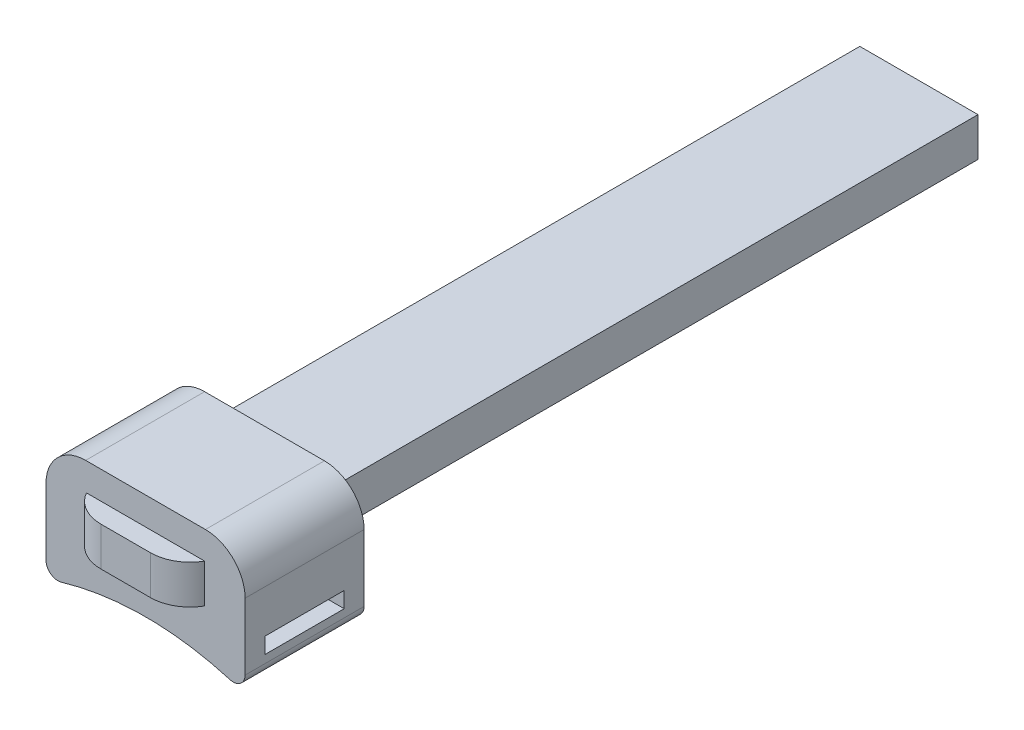
ISO-10303-21;
HEADER;
FILE_DESCRIPTION(('STEP AP214'),'2;1');
FILE_NAME('part.step','',(''),(''),'','','');
FILE_SCHEMA(('AUTOMOTIVE_DESIGN { 1 0 10303 214 1 1 1 1 }'));
ENDSEC;
DATA;
#1=APPLICATION_CONTEXT('core data for automotive mechanical design processes');
#2=APPLICATION_PROTOCOL_DEFINITION('international standard','automotive_design',2000,#1);
#3=PRODUCT_CONTEXT('',#1,'mechanical');
#4=PRODUCT('Part','Part','',(#3));
#5=PRODUCT_RELATED_PRODUCT_CATEGORY('part','',(#4));
#6=PRODUCT_DEFINITION_FORMATION('','',#4);
#7=PRODUCT_DEFINITION_CONTEXT('part definition',#1,'design');
#8=PRODUCT_DEFINITION('design','',#6,#7);
#9=PRODUCT_DEFINITION_SHAPE('','',#8);
#10=(LENGTH_UNIT() NAMED_UNIT(*) SI_UNIT(.MILLI.,.METRE.));
#11=(NAMED_UNIT(*) PLANE_ANGLE_UNIT() SI_UNIT($,.RADIAN.));
#12=(NAMED_UNIT(*) SI_UNIT($,.STERADIAN.) SOLID_ANGLE_UNIT());
#13=UNCERTAINTY_MEASURE_WITH_UNIT(LENGTH_MEASURE(1.E-05),#10,'distance_accuracy_value','');
#14=(GEOMETRIC_REPRESENTATION_CONTEXT(3) GLOBAL_UNCERTAINTY_ASSIGNED_CONTEXT((#13)) GLOBAL_UNIT_ASSIGNED_CONTEXT((#10,
#11,#12)) REPRESENTATION_CONTEXT('',''));
#15=CARTESIAN_POINT('',(0.,0.,0.));
#16=DIRECTION('',(0.,0.,1.));
#17=DIRECTION('',(1.,0.,0.));
#18=AXIS2_PLACEMENT_3D('',#15,#16,#17);
#19=CARTESIAN_POINT('',(-25.1,0.,-35.));
#20=DIRECTION('',(-1.,0.,0.));
#21=DIRECTION('',(0.,0.,1.));
#22=AXIS2_PLACEMENT_3D('',#19,#20,#21);
#23=PLANE('',#22);
#24=DIRECTION('',(0.,-1.,0.));
#25=VECTOR('',#24,1.);
#26=CARTESIAN_POINT('',(-25.1,0.,-5.));
#27=LINE('',#26,#25);
#28=CARTESIAN_POINT('',(-25.1,6.79999999999999,-5.));
#29=VERTEX_POINT('',#28);
#30=CARTESIAN_POINT('',(-25.1,-10.,-5.));
#31=VERTEX_POINT('',#30);
#32=EDGE_CURVE('E261',#29,#31,#27,.T.);
#33=ORIENTED_EDGE('',*,*,#32,.F.);
#34=DIRECTION('',(0.,0.,1.));
#35=VECTOR('',#34,1.);
#36=CARTESIAN_POINT('',(-25.1,6.79999999999999,-35.));
#37=LINE('',#36,#35);
#38=CARTESIAN_POINT('',(-25.1,6.79999999999999,-35.));
#39=VERTEX_POINT('',#38);
#40=EDGE_CURVE('E281',#39,#29,#37,.T.);
#41=ORIENTED_EDGE('',*,*,#40,.F.);
#42=DIRECTION('',(0.,-1.,0.));
#43=VECTOR('',#42,1.);
#44=CARTESIAN_POINT('',(-25.1,0.,-35.));
#45=LINE('',#44,#43);
#46=CARTESIAN_POINT('',(-25.1,-10.,-35.));
#47=VERTEX_POINT('',#46);
#48=EDGE_CURVE('E229',#39,#47,#45,.T.);
#49=ORIENTED_EDGE('',*,*,#48,.T.);
#50=DIRECTION('',(0.,0.,1.));
#51=VECTOR('',#50,1.);
#52=CARTESIAN_POINT('',(-25.1,-10.,-35.));
#53=LINE('',#52,#51);
#54=EDGE_CURVE('E279',#47,#31,#53,.T.);
#55=ORIENTED_EDGE('',*,*,#54,.T.);
#56=EDGE_LOOP('',(#33,#41,#49,#55));
#57=FACE_BOUND('',#56,.T.);
#58=DIRECTION('',(0.,0.,-1.));
#59=VECTOR('',#58,1.);
#60=CARTESIAN_POINT('',(-25.1,-8.,-35.));
#61=LINE('',#60,#59);
#62=CARTESIAN_POINT('',(-25.1,-8.00000000000001,-10.));
#63=VERTEX_POINT('',#62);
#64=CARTESIAN_POINT('',(-25.1,-8.,-30.));
#65=VERTEX_POINT('',#64);
#66=EDGE_CURVE('E206',#63,#65,#61,.T.);
#67=ORIENTED_EDGE('',*,*,#66,.T.);
#68=DIRECTION('',(0.,1.,0.));
#69=VECTOR('',#68,1.);
#70=CARTESIAN_POINT('',(-25.1,0.,-30.));
#71=LINE('',#70,#69);
#72=CARTESIAN_POINT('',(-25.1,-4.00000000000001,-30.));
#73=VERTEX_POINT('',#72);
#74=EDGE_CURVE('E209',#65,#73,#71,.T.);
#75=ORIENTED_EDGE('',*,*,#74,.T.);
#76=DIRECTION('',(0.,0.,1.));
#77=VECTOR('',#76,1.);
#78=CARTESIAN_POINT('',(-25.1,-4.00000000000001,-35.));
#79=LINE('',#78,#77);
#80=CARTESIAN_POINT('',(-25.1,-4.00000000000001,-10.));
#81=VERTEX_POINT('',#80);
#82=EDGE_CURVE('E201',#73,#81,#79,.T.);
#83=ORIENTED_EDGE('',*,*,#82,.T.);
#84=DIRECTION('',(0.,-1.,0.));
#85=VECTOR('',#84,1.);
#86=CARTESIAN_POINT('',(-25.1,0.,-9.99999999999999));
#87=LINE('',#86,#85);
#88=EDGE_CURVE('E182',#81,#63,#87,.T.);
#89=ORIENTED_EDGE('',*,*,#88,.T.);
#90=EDGE_LOOP('',(#67,#75,#83,#89));
#91=FACE_BOUND('',#90,.T.);
#92=ADVANCED_FACE('F40',(#57,#91),#23,.T.);
#93=CARTESIAN_POINT('',(25.1,0.,-35.));
#94=DIRECTION('',(-1.,0.,0.));
#95=DIRECTION('',(0.,0.,1.));
#96=AXIS2_PLACEMENT_3D('',#93,#94,#95);
#97=PLANE('',#96);
#98=DIRECTION('',(0.,-1.,0.));
#99=VECTOR('',#98,1.);
#100=CARTESIAN_POINT('',(25.1,0.,-5.));
#101=LINE('',#100,#99);
#102=CARTESIAN_POINT('',(25.1,6.79999999999999,-5.));
#103=VERTEX_POINT('',#102);
#104=CARTESIAN_POINT('',(25.1,-10.,-5.));
#105=VERTEX_POINT('',#104);
#106=EDGE_CURVE('E249',#103,#105,#101,.T.);
#107=ORIENTED_EDGE('',*,*,#106,.T.);
#108=DIRECTION('',(0.,0.,1.));
#109=VECTOR('',#108,1.);
#110=CARTESIAN_POINT('',(25.1,-10.,-35.));
#111=LINE('',#110,#109);
#112=CARTESIAN_POINT('',(25.1,-10.,-35.));
#113=VERTEX_POINT('',#112);
#114=EDGE_CURVE('E289',#113,#105,#111,.T.);
#115=ORIENTED_EDGE('',*,*,#114,.F.);
#116=DIRECTION('',(0.,-1.,0.));
#117=VECTOR('',#116,1.);
#118=CARTESIAN_POINT('',(25.1,0.,-35.));
#119=LINE('',#118,#117);
#120=CARTESIAN_POINT('',(25.1,6.79999999999999,-35.));
#121=VERTEX_POINT('',#120);
#122=EDGE_CURVE('E219',#121,#113,#119,.T.);
#123=ORIENTED_EDGE('',*,*,#122,.F.);
#124=DIRECTION('',(0.,0.,1.));
#125=VECTOR('',#124,1.);
#126=CARTESIAN_POINT('',(25.1,6.79999999999999,-35.));
#127=LINE('',#126,#125);
#128=EDGE_CURVE('E287',#121,#103,#127,.T.);
#129=ORIENTED_EDGE('',*,*,#128,.T.);
#130=EDGE_LOOP('',(#107,#115,#123,#129));
#131=FACE_BOUND('',#130,.T.);
#132=DIRECTION('',(0.,-1.,0.));
#133=VECTOR('',#132,1.);
#134=CARTESIAN_POINT('',(25.1,0.,-30.));
#135=LINE('',#134,#133);
#136=CARTESIAN_POINT('',(25.1,-4.00000000000001,-30.));
#137=VERTEX_POINT('',#136);
#138=CARTESIAN_POINT('',(25.1,-8.,-30.));
#139=VERTEX_POINT('',#138);
#140=EDGE_CURVE('E63',#137,#139,#135,.T.);
#141=ORIENTED_EDGE('',*,*,#140,.T.);
#142=DIRECTION('',(0.,0.,1.));
#143=VECTOR('',#142,1.);
#144=CARTESIAN_POINT('',(25.1,-8.00000000000001,0.));
#145=LINE('',#144,#143);
#146=CARTESIAN_POINT('',(25.1,-8.00000000000001,-10.));
#147=VERTEX_POINT('',#146);
#148=EDGE_CURVE('E194',#139,#147,#145,.T.);
#149=ORIENTED_EDGE('',*,*,#148,.T.);
#150=DIRECTION('',(0.,1.,0.));
#151=VECTOR('',#150,1.);
#152=CARTESIAN_POINT('',(25.1,0.,-10.));
#153=LINE('',#152,#151);
#154=CARTESIAN_POINT('',(25.1,-4.00000000000001,-10.));
#155=VERTEX_POINT('',#154);
#156=EDGE_CURVE('E179',#147,#155,#153,.T.);
#157=ORIENTED_EDGE('',*,*,#156,.T.);
#158=DIRECTION('',(0.,0.,-1.));
#159=VECTOR('',#158,1.);
#160=CARTESIAN_POINT('',(25.1,-4.00000000000001,0.));
#161=LINE('',#160,#159);
#162=EDGE_CURVE('E188',#155,#137,#161,.T.);
#163=ORIENTED_EDGE('',*,*,#162,.T.);
#164=EDGE_LOOP('',(#141,#149,#157,#163));
#165=FACE_BOUND('',#164,.T.);
#166=ADVANCED_FACE('F192',(#131,#165),#97,.F.);
#167=CARTESIAN_POINT('',(-14.9,0.,-200.));
#168=DIRECTION('',(-1.,0.,0.));
#169=DIRECTION('',(0.,0.,1.));
#170=AXIS2_PLACEMENT_3D('',#167,#168,#169);
#171=PLANE('',#170);
#172=DIRECTION('',(0.,0.,1.));
#173=VECTOR('',#172,1.);
#174=CARTESIAN_POINT('',(-14.9,0.,-200.));
#175=LINE('',#174,#173);
#176=CARTESIAN_POINT('',(-14.9,0.,-200.));
#177=VERTEX_POINT('',#176);
#178=CARTESIAN_POINT('',(-14.9,0.,-35.0000000000001));
#179=VERTEX_POINT('',#178);
#180=EDGE_CURVE('E308',#177,#179,#175,.T.);
#181=ORIENTED_EDGE('',*,*,#180,.T.);
#182=DIRECTION('',(0.,-1.,0.));
#183=VECTOR('',#182,1.);
#184=CARTESIAN_POINT('',(-14.9,0.,-35.));
#185=LINE('',#184,#183);
#186=CARTESIAN_POINT('',(-14.9,9.8,-35.));
#187=VERTEX_POINT('',#186);
#188=EDGE_CURVE('E241',#187,#179,#185,.T.);
#189=ORIENTED_EDGE('',*,*,#188,.F.);
#190=DIRECTION('',(0.,0.,1.));
#191=VECTOR('',#190,1.);
#192=CARTESIAN_POINT('',(-14.9,9.8,-200.));
#193=LINE('',#192,#191);
#194=CARTESIAN_POINT('',(-14.9,9.8,-200.));
#195=VERTEX_POINT('',#194);
#196=EDGE_CURVE('E312',#195,#187,#193,.T.);
#197=ORIENTED_EDGE('',*,*,#196,.F.);
#198=DIRECTION('',(0.,-1.,0.));
#199=VECTOR('',#198,1.);
#200=CARTESIAN_POINT('',(-14.9,0.,-200.));
#201=LINE('',#200,#199);
#202=EDGE_CURVE('E301',#195,#177,#201,.T.);
#203=ORIENTED_EDGE('',*,*,#202,.T.);
#204=EDGE_LOOP('',(#181,#189,#197,#203));
#205=FACE_BOUND('',#204,.T.);
#206=ADVANCED_FACE('F365',(#205),#171,.T.);
#207=CARTESIAN_POINT('',(-14.9,9.8,-200.));
#208=DIRECTION('',(0.,1.,0.));
#209=DIRECTION('',(0.,0.,1.));
#210=AXIS2_PLACEMENT_3D('',#207,#208,#209);
#211=PLANE('',#210);
#212=ORIENTED_EDGE('',*,*,#196,.T.);
#213=DIRECTION('',(-1.,0.,0.));
#214=VECTOR('',#213,1.);
#215=CARTESIAN_POINT('',(0.,9.8,-35.));
#216=LINE('',#215,#214);
#217=CARTESIAN_POINT('',(14.9,9.8,-35.));
#218=VERTEX_POINT('',#217);
#219=EDGE_CURVE('E235',#218,#187,#216,.T.);
#220=ORIENTED_EDGE('',*,*,#219,.F.);
#221=DIRECTION('',(0.,0.,1.));
#222=VECTOR('',#221,1.);
#223=CARTESIAN_POINT('',(14.9,9.8,-200.));
#224=LINE('',#223,#222);
#225=CARTESIAN_POINT('',(14.9,9.8,-200.));
#226=VERTEX_POINT('',#225);
#227=EDGE_CURVE('E315',#226,#218,#224,.T.);
#228=ORIENTED_EDGE('',*,*,#227,.F.);
#229=DIRECTION('',(-1.,0.,0.));
#230=VECTOR('',#229,1.);
#231=CARTESIAN_POINT('',(-14.9,9.8,-200.));
#232=LINE('',#231,#230);
#233=EDGE_CURVE('E298',#226,#195,#232,.T.);
#234=ORIENTED_EDGE('',*,*,#233,.T.);
#235=EDGE_LOOP('',(#212,#220,#228,#234));
#236=FACE_BOUND('',#235,.T.);
#237=ADVANCED_FACE('F357',(#236),#211,.T.);
#238=CARTESIAN_POINT('',(14.9,9.8,-200.));
#239=DIRECTION('',(1.,0.,0.));
#240=DIRECTION('',(0.,0.,-1.));
#241=AXIS2_PLACEMENT_3D('',#238,#239,#240);
#242=PLANE('',#241);
#243=ORIENTED_EDGE('',*,*,#227,.T.);
#244=DIRECTION('',(0.,1.,0.));
#245=VECTOR('',#244,1.);
#246=CARTESIAN_POINT('',(14.9,0.,-35.));
#247=LINE('',#246,#245);
#248=CARTESIAN_POINT('',(14.9,0.,-35.));
#249=VERTEX_POINT('',#248);
#250=EDGE_CURVE('E237',#249,#218,#247,.T.);
#251=ORIENTED_EDGE('',*,*,#250,.F.);
#252=DIRECTION('',(0.,0.,1.));
#253=VECTOR('',#252,1.);
#254=CARTESIAN_POINT('',(14.9,0.,-200.));
#255=LINE('',#254,#253);
#256=CARTESIAN_POINT('',(14.9,0.,-200.));
#257=VERTEX_POINT('',#256);
#258=EDGE_CURVE('E304',#257,#249,#255,.T.);
#259=ORIENTED_EDGE('',*,*,#258,.F.);
#260=DIRECTION('',(0.,1.,0.));
#261=VECTOR('',#260,1.);
#262=CARTESIAN_POINT('',(14.9,9.8,-200.));
#263=LINE('',#262,#261);
#264=EDGE_CURVE('E294',#257,#226,#263,.T.);
#265=ORIENTED_EDGE('',*,*,#264,.T.);
#266=EDGE_LOOP('',(#243,#251,#259,#265));
#267=FACE_BOUND('',#266,.T.);
#268=ADVANCED_FACE('F405',(#267),#242,.T.);
#269=CARTESIAN_POINT('',(0.,0.,-200.));
#270=DIRECTION('',(0.,-1.,0.));
#271=DIRECTION('',(0.,0.,-1.));
#272=AXIS2_PLACEMENT_3D('',#269,#270,#271);
#273=PLANE('',#272);
#274=ORIENTED_EDGE('',*,*,#258,.T.);
#275=DIRECTION('',(1.,0.,0.));
#276=VECTOR('',#275,1.);
#277=CARTESIAN_POINT('',(0.,0.,-35.));
#278=LINE('',#277,#276);
#279=EDGE_CURVE('E239',#179,#249,#278,.T.);
#280=ORIENTED_EDGE('',*,*,#279,.F.);
#281=ORIENTED_EDGE('',*,*,#180,.F.);
#282=DIRECTION('',(1.,0.,0.));
#283=VECTOR('',#282,1.);
#284=CARTESIAN_POINT('',(0.,0.,-200.));
#285=LINE('',#284,#283);
#286=EDGE_CURVE('E292',#177,#257,#285,.T.);
#287=ORIENTED_EDGE('',*,*,#286,.T.);
#288=EDGE_LOOP('',(#274,#280,#281,#287));
#289=FACE_BOUND('',#288,.T.);
#290=ADVANCED_FACE('F398',(#289),#273,.T.);
#291=CARTESIAN_POINT('',(0.,0.,-200.));
#292=DIRECTION('',(0.,0.,-1.));
#293=DIRECTION('',(-1.,0.,0.));
#294=AXIS2_PLACEMENT_3D('',#291,#292,#293);
#295=PLANE('',#294);
#296=ORIENTED_EDGE('',*,*,#286,.F.);
#297=ORIENTED_EDGE('',*,*,#202,.F.);
#298=ORIENTED_EDGE('',*,*,#233,.F.);
#299=ORIENTED_EDGE('',*,*,#264,.F.);
#300=EDGE_LOOP('',(#296,#297,#298,#299));
#301=FACE_BOUND('',#300,.T.);
#302=ADVANCED_FACE('F394',(#301),#295,.T.);
#303=CARTESIAN_POINT('',(0.,-84.8036763802422,-35.));
#304=DIRECTION('',(0.,0.,1.));
#305=DIRECTION('',(1.,0.,0.));
#306=AXIS2_PLACEMENT_3D('',#303,#304,#305);
#307=CYLINDRICAL_SURFACE('',#306,75.);
#308=CARTESIAN_POINT('',(0.,-84.8036763802422,-5.));
#309=DIRECTION('',(0.,0.,1.));
#310=DIRECTION('',(1.,0.,0.));
#311=AXIS2_PLACEMENT_3D('',#308,#309,#310);
#312=CIRCLE('',#311,75.);
#313=CARTESIAN_POINT('',(21.25,-12.8770644761632,-5.));
#314=VERTEX_POINT('',#313);
#315=CARTESIAN_POINT('',(-21.25,-12.8770644761632,-5.));
#316=VERTEX_POINT('',#315);
#317=EDGE_CURVE('E212',#314,#316,#312,.T.);
#318=ORIENTED_EDGE('',*,*,#317,.T.);
#319=DIRECTION('',(0.,0.,1.));
#320=VECTOR('',#319,1.);
#321=CARTESIAN_POINT('',(-21.25,-12.8770644761632,-35.));
#322=LINE('',#321,#320);
#323=CARTESIAN_POINT('',(-21.25,-12.8770644761632,-35.));
#324=VERTEX_POINT('',#323);
#325=EDGE_CURVE('E276',#324,#316,#322,.T.);
#326=ORIENTED_EDGE('',*,*,#325,.F.);
#327=CARTESIAN_POINT('',(0.,-84.8036763802422,-35.));
#328=DIRECTION('',(0.,0.,1.));
#329=DIRECTION('',(1.,0.,0.));
#330=AXIS2_PLACEMENT_3D('',#327,#328,#329);
#331=CIRCLE('',#330,75.);
#332=CARTESIAN_POINT('',(21.25,-12.8770644761632,-35.));
#333=VERTEX_POINT('',#332);
#334=EDGE_CURVE('E213',#333,#324,#331,.T.);
#335=ORIENTED_EDGE('',*,*,#334,.F.);
#336=DIRECTION('',(0.,0.,1.));
#337=VECTOR('',#336,1.);
#338=CARTESIAN_POINT('',(21.25,-12.8770644761632,-35.));
#339=LINE('',#338,#337);
#340=EDGE_CURVE('E243',#333,#314,#339,.T.);
#341=ORIENTED_EDGE('',*,*,#340,.T.);
#342=EDGE_LOOP('',(#318,#326,#335,#341));
#343=FACE_BOUND('',#342,.T.);
#344=ADVANCED_FACE('F391',(#343),#307,.F.);
#345=CARTESIAN_POINT('',(-22.1,-10.,-35.));
#346=DIRECTION('',(0.,0.,1.));
#347=DIRECTION('',(1.,0.,0.));
#348=AXIS2_PLACEMENT_3D('',#345,#346,#347);
#349=CYLINDRICAL_SURFACE('',#348,3.);
#350=CARTESIAN_POINT('',(-22.1,-10.,-5.));
#351=DIRECTION('',(0.,0.,1.));
#352=DIRECTION('',(1.,0.,0.));
#353=AXIS2_PLACEMENT_3D('',#350,#351,#352);
#354=CIRCLE('',#353,3.);
#355=EDGE_CURVE('E264',#31,#316,#354,.T.);
#356=ORIENTED_EDGE('',*,*,#355,.F.);
#357=ORIENTED_EDGE('',*,*,#54,.F.);
#358=CARTESIAN_POINT('',(-22.1,-10.,-35.));
#359=DIRECTION('',(0.,0.,1.));
#360=DIRECTION('',(1.,0.,0.));
#361=AXIS2_PLACEMENT_3D('',#358,#359,#360);
#362=CIRCLE('',#361,3.);
#363=EDGE_CURVE('E232',#47,#324,#362,.T.);
#364=ORIENTED_EDGE('',*,*,#363,.T.);
#365=ORIENTED_EDGE('',*,*,#325,.T.);
#366=EDGE_LOOP('',(#356,#357,#364,#365));
#367=FACE_BOUND('',#366,.T.);
#368=ADVANCED_FACE('F372',(#367),#349,.T.);
#369=CARTESIAN_POINT('',(-15.1,6.79999999999999,-35.));
#370=DIRECTION('',(0.,0.,1.));
#371=DIRECTION('',(1.,0.,0.));
#372=AXIS2_PLACEMENT_3D('',#369,#370,#371);
#373=CYLINDRICAL_SURFACE('',#372,10.);
#374=CARTESIAN_POINT('',(-15.1,6.79999999999999,-5.));
#375=DIRECTION('',(0.,0.,1.));
#376=DIRECTION('',(1.,0.,0.));
#377=AXIS2_PLACEMENT_3D('',#374,#375,#376);
#378=CIRCLE('',#377,10.);
#379=CARTESIAN_POINT('',(-15.1,16.8,-5.));
#380=VERTEX_POINT('',#379);
#381=EDGE_CURVE('E258',#380,#29,#378,.T.);
#382=ORIENTED_EDGE('',*,*,#381,.F.);
#383=DIRECTION('',(0.,0.,1.));
#384=VECTOR('',#383,1.);
#385=CARTESIAN_POINT('',(-15.1,16.8,-35.));
#386=LINE('',#385,#384);
#387=CARTESIAN_POINT('',(-15.1,16.8,-35.));
#388=VERTEX_POINT('',#387);
#389=EDGE_CURVE('E283',#388,#380,#386,.T.);
#390=ORIENTED_EDGE('',*,*,#389,.F.);
#391=CARTESIAN_POINT('',(-15.1,6.79999999999999,-35.));
#392=DIRECTION('',(0.,0.,1.));
#393=DIRECTION('',(1.,0.,0.));
#394=AXIS2_PLACEMENT_3D('',#391,#392,#393);
#395=CIRCLE('',#394,10.);
#396=EDGE_CURVE('E226',#388,#39,#395,.T.);
#397=ORIENTED_EDGE('',*,*,#396,.T.);
#398=ORIENTED_EDGE('',*,*,#40,.T.);
#399=EDGE_LOOP('',(#382,#390,#397,#398));
#400=FACE_BOUND('',#399,.T.);
#401=ADVANCED_FACE('F374',(#400),#373,.T.);
#402=CARTESIAN_POINT('',(0.,16.8,-35.));
#403=DIRECTION('',(0.,-1.,0.));
#404=DIRECTION('',(0.,0.,-1.));
#405=AXIS2_PLACEMENT_3D('',#402,#403,#404);
#406=PLANE('',#405);
#407=DIRECTION('',(1.,0.,0.));
#408=VECTOR('',#407,1.);
#409=CARTESIAN_POINT('',(0.,16.8,-5.));
#410=LINE('',#409,#408);
#411=CARTESIAN_POINT('',(15.1,16.8,-5.));
#412=VERTEX_POINT('',#411);
#413=EDGE_CURVE('E255',#380,#412,#410,.T.);
#414=ORIENTED_EDGE('',*,*,#413,.T.);
#415=DIRECTION('',(0.,0.,1.));
#416=VECTOR('',#415,1.);
#417=CARTESIAN_POINT('',(15.1,16.8,-35.));
#418=LINE('',#417,#416);
#419=CARTESIAN_POINT('',(15.1,16.8,-35.));
#420=VERTEX_POINT('',#419);
#421=EDGE_CURVE('E285',#420,#412,#418,.T.);
#422=ORIENTED_EDGE('',*,*,#421,.F.);
#423=DIRECTION('',(1.,0.,0.));
#424=VECTOR('',#423,1.);
#425=CARTESIAN_POINT('',(0.,16.8,-35.));
#426=LINE('',#425,#424);
#427=EDGE_CURVE('E224',#388,#420,#426,.T.);
#428=ORIENTED_EDGE('',*,*,#427,.F.);
#429=ORIENTED_EDGE('',*,*,#389,.T.);
#430=EDGE_LOOP('',(#414,#422,#428,#429));
#431=FACE_BOUND('',#430,.T.);
#432=ADVANCED_FACE('F377',(#431),#406,.F.);
#433=CARTESIAN_POINT('',(15.1,6.79999999999999,-35.));
#434=DIRECTION('',(0.,0.,1.));
#435=DIRECTION('',(1.,0.,0.));
#436=AXIS2_PLACEMENT_3D('',#433,#434,#435);
#437=CYLINDRICAL_SURFACE('',#436,10.);
#438=CARTESIAN_POINT('',(15.1,6.79999999999999,-5.));
#439=DIRECTION('',(0.,0.,1.));
#440=DIRECTION('',(1.,0.,0.));
#441=AXIS2_PLACEMENT_3D('',#438,#439,#440);
#442=CIRCLE('',#441,10.);
#443=EDGE_CURVE('E252',#103,#412,#442,.T.);
#444=ORIENTED_EDGE('',*,*,#443,.F.);
#445=ORIENTED_EDGE('',*,*,#128,.F.);
#446=CARTESIAN_POINT('',(15.1,6.79999999999999,-35.));
#447=DIRECTION('',(0.,0.,1.));
#448=DIRECTION('',(1.,0.,0.));
#449=AXIS2_PLACEMENT_3D('',#446,#447,#448);
#450=CIRCLE('',#449,10.);
#451=EDGE_CURVE('E221',#121,#420,#450,.T.);
#452=ORIENTED_EDGE('',*,*,#451,.T.);
#453=ORIENTED_EDGE('',*,*,#421,.T.);
#454=EDGE_LOOP('',(#444,#445,#452,#453));
#455=FACE_BOUND('',#454,.T.);
#456=ADVANCED_FACE('F381',(#455),#437,.T.);
#457=CARTESIAN_POINT('',(22.1,-10.,-35.));
#458=DIRECTION('',(0.,0.,1.));
#459=DIRECTION('',(1.,0.,0.));
#460=AXIS2_PLACEMENT_3D('',#457,#458,#459);
#461=CYLINDRICAL_SURFACE('',#460,3.);
#462=CARTESIAN_POINT('',(22.1,-10.,-5.));
#463=DIRECTION('',(0.,0.,1.));
#464=DIRECTION('',(1.,0.,0.));
#465=AXIS2_PLACEMENT_3D('',#462,#463,#464);
#466=CIRCLE('',#465,3.);
#467=EDGE_CURVE('E246',#314,#105,#466,.T.);
#468=ORIENTED_EDGE('',*,*,#467,.F.);
#469=ORIENTED_EDGE('',*,*,#340,.F.);
#470=CARTESIAN_POINT('',(22.1,-10.,-35.));
#471=DIRECTION('',(0.,0.,1.));
#472=DIRECTION('',(1.,0.,0.));
#473=AXIS2_PLACEMENT_3D('',#470,#471,#472);
#474=CIRCLE('',#473,3.);
#475=EDGE_CURVE('E215',#333,#113,#474,.T.);
#476=ORIENTED_EDGE('',*,*,#475,.T.);
#477=ORIENTED_EDGE('',*,*,#114,.T.);
#478=EDGE_LOOP('',(#468,#469,#476,#477));
#479=FACE_BOUND('',#478,.T.);
#480=ADVANCED_FACE('F384',(#479),#461,.T.);
#481=CARTESIAN_POINT('',(0.,0.,-35.));
#482=DIRECTION('',(0.,0.,1.));
#483=DIRECTION('',(1.,0.,0.));
#484=AXIS2_PLACEMENT_3D('',#481,#482,#483);
#485=PLANE('',#484);
#486=ORIENTED_EDGE('',*,*,#334,.T.);
#487=ORIENTED_EDGE('',*,*,#363,.F.);
#488=ORIENTED_EDGE('',*,*,#48,.F.);
#489=ORIENTED_EDGE('',*,*,#396,.F.);
#490=ORIENTED_EDGE('',*,*,#427,.T.);
#491=ORIENTED_EDGE('',*,*,#451,.F.);
#492=ORIENTED_EDGE('',*,*,#122,.T.);
#493=ORIENTED_EDGE('',*,*,#475,.F.);
#494=EDGE_LOOP('',(#486,#487,#488,#489,#490,#491,#492,#493));
#495=FACE_BOUND('',#494,.T.);
#496=ORIENTED_EDGE('',*,*,#219,.T.);
#497=ORIENTED_EDGE('',*,*,#188,.T.);
#498=ORIENTED_EDGE('',*,*,#279,.T.);
#499=ORIENTED_EDGE('',*,*,#250,.T.);
#500=EDGE_LOOP('',(#496,#497,#498,#499));
#501=FACE_BOUND('',#500,.T.);
#502=ADVANCED_FACE('F389',(#495,#501),#485,.F.);
#503=CARTESIAN_POINT('',(0.,0.,-5.));
#504=DIRECTION('',(0.,0.,1.));
#505=DIRECTION('',(1.,0.,0.));
#506=AXIS2_PLACEMENT_3D('',#503,#504,#505);
#507=PLANE('',#506);
#508=ORIENTED_EDGE('',*,*,#317,.F.);
#509=ORIENTED_EDGE('',*,*,#467,.T.);
#510=ORIENTED_EDGE('',*,*,#106,.F.);
#511=ORIENTED_EDGE('',*,*,#443,.T.);
#512=ORIENTED_EDGE('',*,*,#413,.F.);
#513=ORIENTED_EDGE('',*,*,#381,.T.);
#514=ORIENTED_EDGE('',*,*,#32,.T.);
#515=ORIENTED_EDGE('',*,*,#355,.T.);
#516=EDGE_LOOP('',(#508,#509,#510,#511,#512,#513,#514,#515));
#517=FACE_BOUND('',#516,.T.);
#518=DIRECTION('',(-1.,0.,0.));
#519=VECTOR('',#518,1.);
#520=CARTESIAN_POINT('',(0.,9.8,-5.));
#521=LINE('',#520,#519);
#522=CARTESIAN_POINT('',(14.9,9.8,-5.00000000000006));
#523=VERTEX_POINT('',#522);
#524=CARTESIAN_POINT('',(-14.9,9.8,-5.00000000000006));
#525=VERTEX_POINT('',#524);
#526=EDGE_CURVE('E267',#523,#525,#521,.T.);
#527=ORIENTED_EDGE('',*,*,#526,.F.);
#528=DIRECTION('',(0.,1.,0.));
#529=VECTOR('',#528,1.);
#530=CARTESIAN_POINT('',(14.9,0.,-5.));
#531=LINE('',#530,#529);
#532=CARTESIAN_POINT('',(14.9,0.,-5.00000000000006));
#533=VERTEX_POINT('',#532);
#534=EDGE_CURVE('E269',#533,#523,#531,.T.);
#535=ORIENTED_EDGE('',*,*,#534,.F.);
#536=DIRECTION('',(1.,0.,0.));
#537=VECTOR('',#536,1.);
#538=CARTESIAN_POINT('',(0.,0.,-5.));
#539=LINE('',#538,#537);
#540=CARTESIAN_POINT('',(-14.9,0.,-5.));
#541=VERTEX_POINT('',#540);
#542=EDGE_CURVE('E272',#541,#533,#539,.T.);
#543=ORIENTED_EDGE('',*,*,#542,.F.);
#544=DIRECTION('',(0.,-1.,0.));
#545=VECTOR('',#544,1.);
#546=CARTESIAN_POINT('',(-14.9,0.,-5.));
#547=LINE('',#546,#545);
#548=EDGE_CURVE('E216',#525,#541,#547,.T.);
#549=ORIENTED_EDGE('',*,*,#548,.F.);
#550=EDGE_LOOP('',(#527,#535,#543,#549));
#551=FACE_BOUND('',#550,.T.);
#552=ADVANCED_FACE('F339',(#517,#551),#507,.T.);
#553=CARTESIAN_POINT('',(0.,0.,0.));
#554=DIRECTION('',(0.,0.,-1.));
#555=DIRECTION('',(-1.,0.,0.));
#556=AXIS2_PLACEMENT_3D('',#553,#554,#555);
#557=PLANE('',#556);
#558=DIRECTION('',(-1.,0.,0.));
#559=VECTOR('',#558,1.);
#560=CARTESIAN_POINT('',(-14.9,9.8,0.));
#561=LINE('',#560,#559);
#562=CARTESIAN_POINT('',(6.23974596215561,9.8,0.));
#563=VERTEX_POINT('',#562);
#564=CARTESIAN_POINT('',(-6.23974596215561,9.8,0.));
#565=VERTEX_POINT('',#564);
#566=EDGE_CURVE('E295',#563,#565,#561,.T.);
#567=ORIENTED_EDGE('',*,*,#566,.T.);
#568=DIRECTION('',(0.,1.,0.));
#569=VECTOR('',#568,1.);
#570=CARTESIAN_POINT('',(-6.23974596215561,0.,0.));
#571=LINE('',#570,#569);
#572=CARTESIAN_POINT('',(-6.23974596215561,0.,0.));
#573=VERTEX_POINT('',#572);
#574=EDGE_CURVE('E327',#565,#573,#571,.F.);
#575=ORIENTED_EDGE('',*,*,#574,.T.);
#576=DIRECTION('',(1.,0.,0.));
#577=VECTOR('',#576,1.);
#578=CARTESIAN_POINT('',(0.,0.,0.));
#579=LINE('',#578,#577);
#580=CARTESIAN_POINT('',(6.23974596215561,0.,0.));
#581=VERTEX_POINT('',#580);
#582=EDGE_CURVE('E278',#573,#581,#579,.T.);
#583=ORIENTED_EDGE('',*,*,#582,.T.);
#584=DIRECTION('',(0.,-1.,0.));
#585=VECTOR('',#584,1.);
#586=CARTESIAN_POINT('',(6.23974596215561,0.,0.));
#587=LINE('',#586,#585);
#588=EDGE_CURVE('E311',#581,#563,#587,.F.);
#589=ORIENTED_EDGE('',*,*,#588,.T.);
#590=EDGE_LOOP('',(#567,#575,#583,#589));
#591=FACE_BOUND('',#590,.T.);
#592=ADVANCED_FACE('F346',(#591),#557,.F.);
#593=ORIENTED_EDGE('',*,*,#582,.F.);
#594=CARTESIAN_POINT('',(-6.23974596215561,0.,-10.));
#595=DIRECTION('',(0.,-1.,0.));
#596=DIRECTION('',(0.,0.,-1.));
#597=AXIS2_PLACEMENT_3D('',#594,#595,#596);
#598=CIRCLE('',#597,10.);
#599=EDGE_CURVE('E48',#573,#541,#598,.T.);
#600=ORIENTED_EDGE('',*,*,#599,.T.);
#601=ORIENTED_EDGE('',*,*,#542,.T.);
#602=CARTESIAN_POINT('',(6.23974596215561,0.,-10.));
#603=DIRECTION('',(0.,-1.,0.));
#604=DIRECTION('',(0.,0.,-1.));
#605=AXIS2_PLACEMENT_3D('',#602,#603,#604);
#606=CIRCLE('',#605,10.);
#607=EDGE_CURVE('E324',#533,#581,#606,.T.);
#608=ORIENTED_EDGE('',*,*,#607,.T.);
#609=EDGE_LOOP('',(#593,#600,#601,#608));
#610=FACE_BOUND('',#609,.T.);
#611=ADVANCED_FACE('F332',(#610),#273,.T.);
#612=ORIENTED_EDGE('',*,*,#526,.T.);
#613=CARTESIAN_POINT('',(-6.23974596215561,9.8,-10.));
#614=DIRECTION('',(0.,1.,0.));
#615=DIRECTION('',(0.,0.,1.));
#616=AXIS2_PLACEMENT_3D('',#613,#614,#615);
#617=CIRCLE('',#616,10.);
#618=EDGE_CURVE('E11',#525,#565,#617,.T.);
#619=ORIENTED_EDGE('',*,*,#618,.T.);
#620=ORIENTED_EDGE('',*,*,#566,.F.);
#621=CARTESIAN_POINT('',(6.23974596215561,9.8,-10.));
#622=DIRECTION('',(0.,1.,0.));
#623=DIRECTION('',(0.,0.,1.));
#624=AXIS2_PLACEMENT_3D('',#621,#622,#623);
#625=CIRCLE('',#624,10.);
#626=EDGE_CURVE('E322',#563,#523,#625,.T.);
#627=ORIENTED_EDGE('',*,*,#626,.T.);
#628=EDGE_LOOP('',(#612,#619,#620,#627));
#629=FACE_BOUND('',#628,.T.);
#630=ADVANCED_FACE('F344',(#629),#211,.T.);
#631=CARTESIAN_POINT('',(6.23974596215561,9.8,-10.));
#632=DIRECTION('',(0.,-1.,0.));
#633=DIRECTION('',(0.,0.,-1.));
#634=AXIS2_PLACEMENT_3D('',#631,#632,#633);
#635=CYLINDRICAL_SURFACE('',#634,10.);
#636=ORIENTED_EDGE('',*,*,#607,.F.);
#637=ORIENTED_EDGE('',*,*,#534,.T.);
#638=ORIENTED_EDGE('',*,*,#626,.F.);
#639=ORIENTED_EDGE('',*,*,#588,.F.);
#640=EDGE_LOOP('',(#636,#637,#638,#639));
#641=FACE_BOUND('',#640,.T.);
#642=ADVANCED_FACE('F349',(#641),#635,.T.);
#643=CARTESIAN_POINT('',(-6.23974596215561,0.,-10.));
#644=DIRECTION('',(0.,1.,0.));
#645=DIRECTION('',(0.,0.,1.));
#646=AXIS2_PLACEMENT_3D('',#643,#644,#645);
#647=CYLINDRICAL_SURFACE('',#646,10.);
#648=ORIENTED_EDGE('',*,*,#618,.F.);
#649=ORIENTED_EDGE('',*,*,#548,.T.);
#650=ORIENTED_EDGE('',*,*,#599,.F.);
#651=ORIENTED_EDGE('',*,*,#574,.F.);
#652=EDGE_LOOP('',(#648,#649,#650,#651));
#653=FACE_BOUND('',#652,.T.);
#654=ADVANCED_FACE('F42',(#653),#647,.T.);
#655=CARTESIAN_POINT('',(-30.9,0.,-30.));
#656=DIRECTION('',(0.,0.,1.));
#657=DIRECTION('',(1.,0.,0.));
#658=AXIS2_PLACEMENT_3D('',#655,#656,#657);
#659=PLANE('',#658);
#660=DIRECTION('',(1.,0.,0.));
#661=VECTOR('',#660,1.);
#662=CARTESIAN_POINT('',(-30.9,-8.,-30.));
#663=LINE('',#662,#661);
#664=EDGE_CURVE('E199',#65,#139,#663,.T.);
#665=ORIENTED_EDGE('',*,*,#664,.T.);
#666=ORIENTED_EDGE('',*,*,#140,.F.);
#667=DIRECTION('',(1.,0.,0.));
#668=VECTOR('',#667,1.);
#669=CARTESIAN_POINT('',(-30.9,-4.00000000000001,-30.));
#670=LINE('',#669,#668);
#671=EDGE_CURVE('E185',#73,#137,#670,.T.);
#672=ORIENTED_EDGE('',*,*,#671,.F.);
#673=ORIENTED_EDGE('',*,*,#74,.F.);
#674=EDGE_LOOP('',(#665,#666,#672,#673));
#675=FACE_BOUND('',#674,.T.);
#676=ADVANCED_FACE('F355',(#675),#659,.T.);
#677=CARTESIAN_POINT('',(-30.9,-8.00000000000001,0.));
#678=DIRECTION('',(0.,1.,0.));
#679=DIRECTION('',(0.,0.,1.));
#680=AXIS2_PLACEMENT_3D('',#677,#678,#679);
#681=PLANE('',#680);
#682=DIRECTION('',(1.,0.,0.));
#683=VECTOR('',#682,1.);
#684=CARTESIAN_POINT('',(-30.9,-8.00000000000001,-10.));
#685=LINE('',#684,#683);
#686=EDGE_CURVE('E184',#63,#147,#685,.T.);
#687=ORIENTED_EDGE('',*,*,#686,.T.);
#688=ORIENTED_EDGE('',*,*,#148,.F.);
#689=ORIENTED_EDGE('',*,*,#664,.F.);
#690=ORIENTED_EDGE('',*,*,#66,.F.);
#691=EDGE_LOOP('',(#687,#688,#689,#690));
#692=FACE_BOUND('',#691,.T.);
#693=ADVANCED_FACE('F436',(#692),#681,.T.);
#694=CARTESIAN_POINT('',(-30.9,0.,-10.));
#695=DIRECTION('',(0.,0.,-1.));
#696=DIRECTION('',(-1.,0.,0.));
#697=AXIS2_PLACEMENT_3D('',#694,#695,#696);
#698=PLANE('',#697);
#699=DIRECTION('',(1.,0.,0.));
#700=VECTOR('',#699,1.);
#701=CARTESIAN_POINT('',(-30.9,-4.00000000000001,-10.));
#702=LINE('',#701,#700);
#703=EDGE_CURVE('E55',#81,#155,#702,.T.);
#704=ORIENTED_EDGE('',*,*,#703,.T.);
#705=ORIENTED_EDGE('',*,*,#156,.F.);
#706=ORIENTED_EDGE('',*,*,#686,.F.);
#707=ORIENTED_EDGE('',*,*,#88,.F.);
#708=EDGE_LOOP('',(#704,#705,#706,#707));
#709=FACE_BOUND('',#708,.T.);
#710=ADVANCED_FACE('F176',(#709),#698,.T.);
#711=CARTESIAN_POINT('',(-30.9,-4.00000000000001,0.));
#712=DIRECTION('',(0.,-1.,0.));
#713=DIRECTION('',(0.,0.,-1.));
#714=AXIS2_PLACEMENT_3D('',#711,#712,#713);
#715=PLANE('',#714);
#716=ORIENTED_EDGE('',*,*,#671,.T.);
#717=ORIENTED_EDGE('',*,*,#162,.F.);
#718=ORIENTED_EDGE('',*,*,#703,.F.);
#719=ORIENTED_EDGE('',*,*,#82,.F.);
#720=EDGE_LOOP('',(#716,#717,#718,#719));
#721=FACE_BOUND('',#720,.T.);
#722=ADVANCED_FACE('F189',(#721),#715,.T.);
#723=CLOSED_SHELL('',(#92,#166,#206,#237,#268,#290,#302,#344,#368,#401,#432,#456,#480,#502,#552,
#592,#611,#630,#642,#654,#676,#693,#710,#722));
#724=MANIFOLD_SOLID_BREP('B2',#723);
#725=ADVANCED_BREP_SHAPE_REPRESENTATION('',(#18,#724),#14);
#726=SHAPE_DEFINITION_REPRESENTATION(#9,#725);
ENDSEC;
END-ISO-10303-21;
